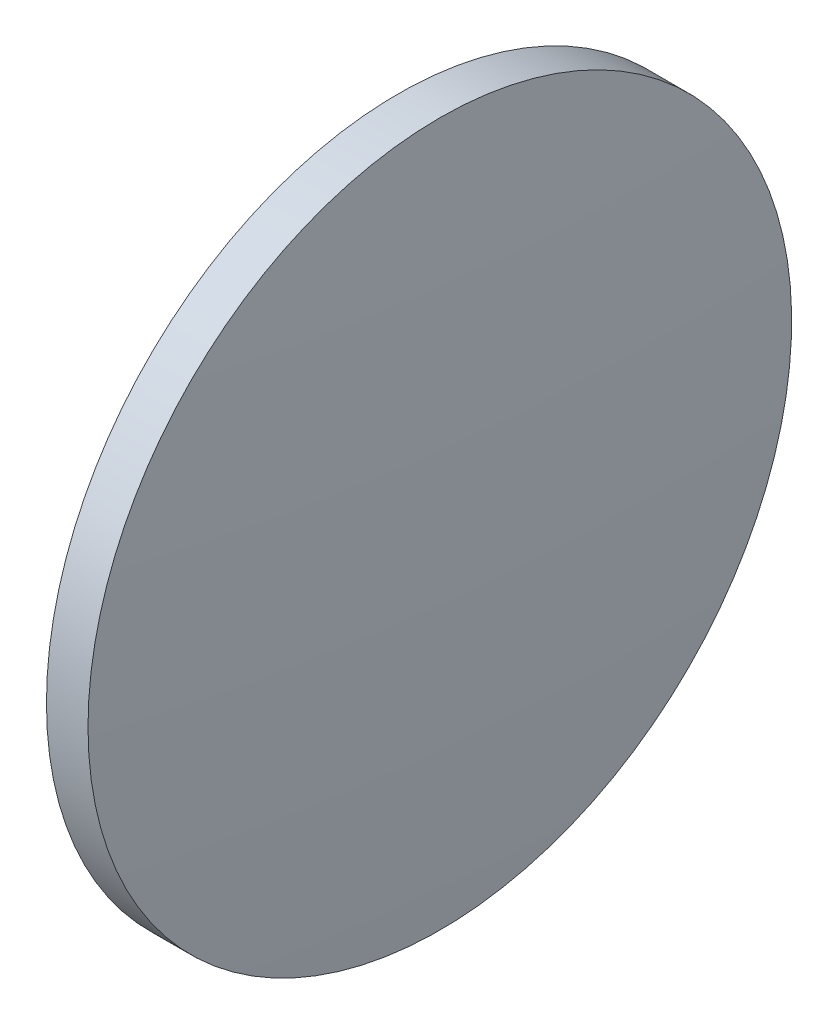
ISO-10303-21;
HEADER;
FILE_DESCRIPTION(('STEP AP214'),'2;1');
FILE_NAME('part.step','',(''),(''),'','','');
FILE_SCHEMA(('AUTOMOTIVE_DESIGN { 1 0 10303 214 1 1 1 1 }'));
ENDSEC;
DATA;
#1=APPLICATION_CONTEXT('core data for automotive mechanical design processes');
#2=APPLICATION_PROTOCOL_DEFINITION('international standard','automotive_design',2000,#1);
#3=PRODUCT_CONTEXT('',#1,'mechanical');
#4=PRODUCT('Part','Part','',(#3));
#5=PRODUCT_RELATED_PRODUCT_CATEGORY('part','',(#4));
#6=PRODUCT_DEFINITION_FORMATION('','',#4);
#7=PRODUCT_DEFINITION_CONTEXT('part definition',#1,'design');
#8=PRODUCT_DEFINITION('design','',#6,#7);
#9=PRODUCT_DEFINITION_SHAPE('','',#8);
#10=(LENGTH_UNIT() NAMED_UNIT(*) SI_UNIT(.MILLI.,.METRE.));
#11=(NAMED_UNIT(*) PLANE_ANGLE_UNIT() SI_UNIT($,.RADIAN.));
#12=(NAMED_UNIT(*) SI_UNIT($,.STERADIAN.) SOLID_ANGLE_UNIT());
#13=UNCERTAINTY_MEASURE_WITH_UNIT(LENGTH_MEASURE(1.E-05),#10,'distance_accuracy_value','');
#14=(GEOMETRIC_REPRESENTATION_CONTEXT(3) GLOBAL_UNCERTAINTY_ASSIGNED_CONTEXT((#13)) GLOBAL_UNIT_ASSIGNED_CONTEXT((#10,
#11,#12)) REPRESENTATION_CONTEXT('',''));
#15=CARTESIAN_POINT('',(0.,0.,0.));
#16=DIRECTION('',(0.,0.,1.));
#17=DIRECTION('',(1.,0.,0.));
#18=AXIS2_PLACEMENT_3D('',#15,#16,#17);
#19=CARTESIAN_POINT('',(-122.951402142978,130.467109852824,0.));
#20=DIRECTION('',(-1.,0.,0.));
#21=DIRECTION('',(0.,1.,0.));
#22=AXIS2_PLACEMENT_3D('',#19,#20,#21);
#23=SPHERICAL_SURFACE('',#22,358.87222222222);
#24=CARTESIAN_POINT('',(235.020820079242,130.467109852824,0.));
#25=DIRECTION('',(-1.,0.,0.));
#26=DIRECTION('',(0.,0.,1.));
#27=AXIS2_PLACEMENT_3D('',#24,#25,#26);
#28=CIRCLE('',#27,25.4);
#29=CARTESIAN_POINT('',(235.020820079242,130.467109852824,25.4));
#30=VERTEX_POINT('',#29);
#31=EDGE_CURVE('E10',#30,#30,#28,.T.);
#32=ORIENTED_EDGE('',*,*,#31,.F.);
#33=EDGE_LOOP('',(#32));
#34=FACE_BOUND('',#33,.T.);
#35=ADVANCED_FACE('F35',(#34),#23,.T.);
#36=CARTESIAN_POINT('',(220.330746456977,130.467109852824,0.));
#37=DIRECTION('',(-1.,0.,0.));
#38=DIRECTION('',(0.,0.,1.));
#39=AXIS2_PLACEMENT_3D('',#36,#37,#38);
#40=CYLINDRICAL_SURFACE('',#39,25.4);
#41=CARTESIAN_POINT('',(232.020820079242,130.467109852824,0.));
#42=DIRECTION('',(-1.,0.,0.));
#43=DIRECTION('',(0.,0.,1.));
#44=AXIS2_PLACEMENT_3D('',#41,#42,#43);
#45=CIRCLE('',#44,25.4);
#46=CARTESIAN_POINT('',(232.020820079242,130.467109852824,25.4));
#47=VERTEX_POINT('',#46);
#48=EDGE_CURVE('E41',#47,#47,#45,.T.);
#49=ORIENTED_EDGE('',*,*,#48,.F.);
#50=EDGE_LOOP('',(#49));
#51=FACE_BOUND('',#50,.T.);
#52=ORIENTED_EDGE('',*,*,#31,.T.);
#53=EDGE_LOOP('',(#52));
#54=FACE_BOUND('',#53,.T.);
#55=ADVANCED_FACE('F49',(#51,#54),#40,.T.);
#56=CARTESIAN_POINT('',(232.020820079242,130.467109852824,0.));
#57=DIRECTION('',(1.,0.,0.));
#58=DIRECTION('',(0.,0.,-1.));
#59=AXIS2_PLACEMENT_3D('',#56,#57,#58);
#60=PLANE('',#59);
#61=ORIENTED_EDGE('',*,*,#48,.T.);
#62=EDGE_LOOP('',(#61));
#63=FACE_BOUND('',#62,.T.);
#64=ADVANCED_FACE('F47',(#63),#60,.F.);
#65=CLOSED_SHELL('',(#35,#55,#64));
#66=MANIFOLD_SOLID_BREP('B2',#65);
#67=ADVANCED_BREP_SHAPE_REPRESENTATION('',(#18,#66),#14);
#68=SHAPE_DEFINITION_REPRESENTATION(#9,#67);
ENDSEC;
END-ISO-10303-21;
